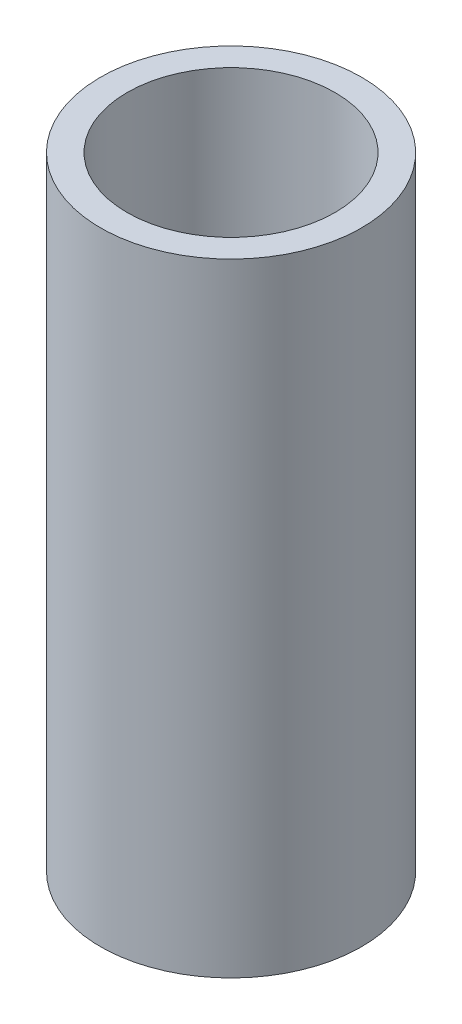
ISO-10303-21;
HEADER;
FILE_DESCRIPTION(('STEP AP214'),'2;1');
FILE_NAME('part.step','',(''),(''),'','','');
FILE_SCHEMA(('AUTOMOTIVE_DESIGN { 1 0 10303 214 1 1 1 1 }'));
ENDSEC;
DATA;
#1=APPLICATION_CONTEXT('core data for automotive mechanical design processes');
#2=APPLICATION_PROTOCOL_DEFINITION('international standard','automotive_design',2000,#1);
#3=PRODUCT_CONTEXT('',#1,'mechanical');
#4=PRODUCT('Part','Part','',(#3));
#5=PRODUCT_RELATED_PRODUCT_CATEGORY('part','',(#4));
#6=PRODUCT_DEFINITION_FORMATION('','',#4);
#7=PRODUCT_DEFINITION_CONTEXT('part definition',#1,'design');
#8=PRODUCT_DEFINITION('design','',#6,#7);
#9=PRODUCT_DEFINITION_SHAPE('','',#8);
#10=(LENGTH_UNIT() NAMED_UNIT(*) SI_UNIT(.MILLI.,.METRE.));
#11=(NAMED_UNIT(*) PLANE_ANGLE_UNIT() SI_UNIT($,.RADIAN.));
#12=(NAMED_UNIT(*) SI_UNIT($,.STERADIAN.) SOLID_ANGLE_UNIT());
#13=UNCERTAINTY_MEASURE_WITH_UNIT(LENGTH_MEASURE(1.E-05),#10,'distance_accuracy_value','');
#14=(GEOMETRIC_REPRESENTATION_CONTEXT(3) GLOBAL_UNCERTAINTY_ASSIGNED_CONTEXT((#13)) GLOBAL_UNIT_ASSIGNED_CONTEXT((#10,
#11,#12)) REPRESENTATION_CONTEXT('',''));
#15=CARTESIAN_POINT('',(0.,0.,0.));
#16=DIRECTION('',(0.,0.,1.));
#17=DIRECTION('',(1.,0.,0.));
#18=AXIS2_PLACEMENT_3D('',#15,#16,#17);
#19=CARTESIAN_POINT('',(-32.08466479319,87.8273391833658,14.8398113237099));
#20=DIRECTION('',(0.,-1.,0.));
#21=DIRECTION('',(0.,0.,-1.));
#22=AXIS2_PLACEMENT_3D('',#19,#20,#21);
#23=CYLINDRICAL_SURFACE('',#22,3.18135);
#24=CARTESIAN_POINT('',(-32.08466479319,68.7773391833658,14.8398113237099));
#25=DIRECTION('',(0.,-1.,0.));
#26=DIRECTION('',(0.,0.,-1.));
#27=AXIS2_PLACEMENT_3D('',#24,#25,#26);
#28=CIRCLE('',#27,3.18135);
#29=CARTESIAN_POINT('',(-32.08466479319,68.7773391833658,11.6584613237099));
#30=VERTEX_POINT('',#29);
#31=EDGE_CURVE('E27',#30,#30,#28,.T.);
#32=ORIENTED_EDGE('',*,*,#31,.T.);
#33=EDGE_LOOP('',(#32));
#34=FACE_BOUND('',#33,.T.);
#35=CARTESIAN_POINT('',(-32.08466479319,87.8273391833658,14.8398113237099));
#36=DIRECTION('',(0.,-1.,0.));
#37=DIRECTION('',(0.,0.,-1.));
#38=AXIS2_PLACEMENT_3D('',#35,#36,#37);
#39=CIRCLE('',#38,3.18135);
#40=CARTESIAN_POINT('',(-32.08466479319,87.8273391833658,11.6584613237099));
#41=VERTEX_POINT('',#40);
#42=EDGE_CURVE('E18',#41,#41,#39,.T.);
#43=ORIENTED_EDGE('',*,*,#42,.F.);
#44=EDGE_LOOP('',(#43));
#45=FACE_BOUND('',#44,.T.);
#46=ADVANCED_FACE('F15',(#34,#45),#23,.F.);
#47=CARTESIAN_POINT('',(-32.08466479319,87.8273391833658,14.8398113237099));
#48=DIRECTION('',(0.,1.,0.));
#49=DIRECTION('',(0.,0.,1.));
#50=AXIS2_PLACEMENT_3D('',#47,#48,#49);
#51=PLANE('',#50);
#52=ORIENTED_EDGE('',*,*,#42,.T.);
#53=EDGE_LOOP('',(#52));
#54=FACE_BOUND('',#53,.T.);
#55=CARTESIAN_POINT('',(-32.08466479319,87.8273391833658,14.8398113237099));
#56=DIRECTION('',(0.,-1.,0.));
#57=DIRECTION('',(0.,0.,-1.));
#58=AXIS2_PLACEMENT_3D('',#55,#56,#57);
#59=CIRCLE('',#58,3.99415);
#60=CARTESIAN_POINT('',(-32.08466479319,87.8273391833658,10.8456613237099));
#61=VERTEX_POINT('',#60);
#62=EDGE_CURVE('E22',#61,#61,#59,.T.);
#63=ORIENTED_EDGE('',*,*,#62,.F.);
#64=EDGE_LOOP('',(#63));
#65=FACE_BOUND('',#64,.T.);
#66=ADVANCED_FACE('F35',(#54,#65),#51,.T.);
#67=CARTESIAN_POINT('',(-32.08466479319,68.7773391833658,14.8398113237099));
#68=DIRECTION('',(0.,1.,0.));
#69=DIRECTION('',(0.,0.,1.));
#70=AXIS2_PLACEMENT_3D('',#67,#68,#69);
#71=PLANE('',#70);
#72=ORIENTED_EDGE('',*,*,#31,.F.);
#73=EDGE_LOOP('',(#72));
#74=FACE_BOUND('',#73,.T.);
#75=CARTESIAN_POINT('',(-32.08466479319,68.7773391833658,14.8398113237099));
#76=DIRECTION('',(0.,-1.,0.));
#77=DIRECTION('',(0.,0.,-1.));
#78=AXIS2_PLACEMENT_3D('',#75,#76,#77);
#79=CIRCLE('',#78,3.99415);
#80=CARTESIAN_POINT('',(-32.08466479319,68.7773391833658,10.8456613237099));
#81=VERTEX_POINT('',#80);
#82=EDGE_CURVE('E10',#81,#81,#79,.F.);
#83=ORIENTED_EDGE('',*,*,#82,.F.);
#84=EDGE_LOOP('',(#83));
#85=FACE_BOUND('',#84,.T.);
#86=ADVANCED_FACE('F43',(#74,#85),#71,.F.);
#87=CARTESIAN_POINT('',(-32.08466479319,87.8273391833658,14.8398113237099));
#88=DIRECTION('',(0.,-1.,0.));
#89=DIRECTION('',(0.,0.,-1.));
#90=AXIS2_PLACEMENT_3D('',#87,#88,#89);
#91=CYLINDRICAL_SURFACE('',#90,3.99415);
#92=ORIENTED_EDGE('',*,*,#82,.T.);
#93=EDGE_LOOP('',(#92));
#94=FACE_BOUND('',#93,.T.);
#95=ORIENTED_EDGE('',*,*,#62,.T.);
#96=EDGE_LOOP('',(#95));
#97=FACE_BOUND('',#96,.T.);
#98=ADVANCED_FACE('F44',(#94,#97),#91,.T.);
#99=CLOSED_SHELL('',(#46,#66,#86,#98));
#100=MANIFOLD_SOLID_BREP('B1',#99);
#101=ADVANCED_BREP_SHAPE_REPRESENTATION('',(#18,#100),#14);
#102=SHAPE_DEFINITION_REPRESENTATION(#9,#101);
ENDSEC;
END-ISO-10303-21;
